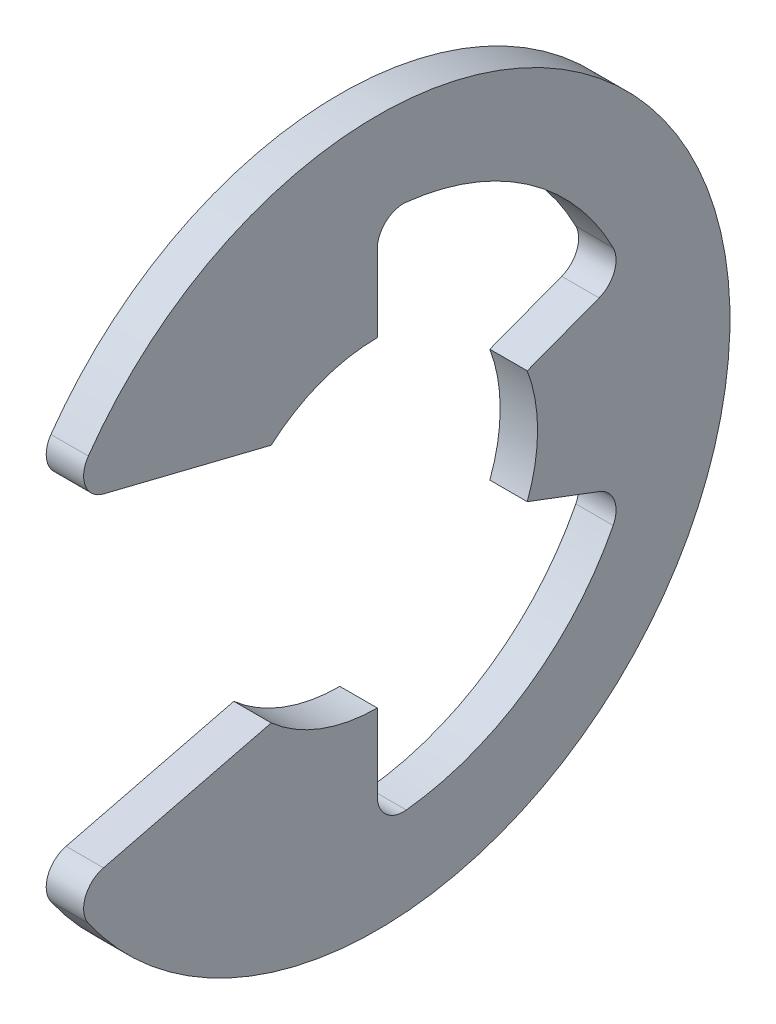
ISO-10303-21;
HEADER;
FILE_DESCRIPTION(('STEP AP214'),'2;1');
FILE_NAME('part.step','',(''),(''),'','','');
FILE_SCHEMA(('AUTOMOTIVE_DESIGN { 1 0 10303 214 1 1 1 1 }'));
ENDSEC;
DATA;
#1=APPLICATION_CONTEXT('core data for automotive mechanical design processes');
#2=APPLICATION_PROTOCOL_DEFINITION('international standard','automotive_design',2000,#1);
#3=PRODUCT_CONTEXT('',#1,'mechanical');
#4=PRODUCT('Part','Part','',(#3));
#5=PRODUCT_RELATED_PRODUCT_CATEGORY('part','',(#4));
#6=PRODUCT_DEFINITION_FORMATION('','',#4);
#7=PRODUCT_DEFINITION_CONTEXT('part definition',#1,'design');
#8=PRODUCT_DEFINITION('design','',#6,#7);
#9=PRODUCT_DEFINITION_SHAPE('','',#8);
#10=(LENGTH_UNIT() NAMED_UNIT(*) SI_UNIT(.MILLI.,.METRE.));
#11=(NAMED_UNIT(*) PLANE_ANGLE_UNIT() SI_UNIT($,.RADIAN.));
#12=(NAMED_UNIT(*) SI_UNIT($,.STERADIAN.) SOLID_ANGLE_UNIT());
#13=UNCERTAINTY_MEASURE_WITH_UNIT(LENGTH_MEASURE(1.E-05),#10,'distance_accuracy_value','');
#14=(GEOMETRIC_REPRESENTATION_CONTEXT(3) GLOBAL_UNCERTAINTY_ASSIGNED_CONTEXT((#13)) GLOBAL_UNIT_ASSIGNED_CONTEXT((#10,
#11,#12)) REPRESENTATION_CONTEXT('',''));
#15=CARTESIAN_POINT('',(0.,0.,0.));
#16=DIRECTION('',(0.,0.,1.));
#17=DIRECTION('',(1.,0.,0.));
#18=AXIS2_PLACEMENT_3D('',#15,#16,#17);
#19=CARTESIAN_POINT('',(0.4445,0.,0.));
#20=DIRECTION('',(1.,0.,0.));
#21=DIRECTION('',(0.,0.,-1.));
#22=AXIS2_PLACEMENT_3D('',#19,#20,#21);
#23=PLANE('',#22);
#24=DIRECTION('',(0.,-1.,0.));
#25=VECTOR('',#24,1.);
#26=CARTESIAN_POINT('',(0.4445,-3.81,0.));
#27=LINE('',#26,#25);
#28=CARTESIAN_POINT('',(0.4445,-5.63609412257,0.));
#29=VERTEX_POINT('',#28);
#30=CARTESIAN_POINT('',(0.4445,-3.81,0.));
#31=VERTEX_POINT('',#30);
#32=EDGE_CURVE('E167',#29,#31,#27,.F.);
#33=ORIENTED_EDGE('',*,*,#32,.T.);
#34=CARTESIAN_POINT('',(0.4445,0.,0.));
#35=DIRECTION('',(-1.,0.,0.));
#36=DIRECTION('',(0.,0.,1.));
#37=AXIS2_PLACEMENT_3D('',#34,#35,#36);
#38=CIRCLE('',#37,3.81);
#39=CARTESIAN_POINT('',(0.4445,-2.85750000000024,2.5200781237894));
#40=VERTEX_POINT('',#39);
#41=EDGE_CURVE('E222',#31,#40,#38,.T.);
#42=ORIENTED_EDGE('',*,*,#41,.T.);
#43=DIRECTION('',(0.,0.24095282060708,-0.970536829925322));
#44=VECTOR('',#43,1.);
#45=CARTESIAN_POINT('',(0.4445,-4.05333224144,7.33678551823));
#46=LINE('',#45,#44);
#47=CARTESIAN_POINT('',(0.4445,-3.84710424199829,6.506117222612));
#48=VERTEX_POINT('',#47);
#49=EDGE_CURVE('E162',#40,#48,#46,.F.);
#50=ORIENTED_EDGE('',*,*,#49,.T.);
#51=CARTESIAN_POINT('',(0.4445,-4.45106931115,6.35617228191));
#52=DIRECTION('',(-1.,0.,0.));
#53=DIRECTION('',(0.,0.,1.));
#54=AXIS2_PLACEMENT_3D('',#51,#52,#53);
#55=CIRCLE('',#54,0.6223);
#56=CARTESIAN_POINT('',(0.4445,-4.80802904314069,6.86591441253935));
#57=VERTEX_POINT('',#56);
#58=EDGE_CURVE('E219',#57,#48,#55,.T.);
#59=ORIENTED_EDGE('',*,*,#58,.F.);
#60=CARTESIAN_POINT('',(0.4445,0.,0.));
#61=DIRECTION('',(-1.,0.,0.));
#62=DIRECTION('',(0.,0.,1.));
#63=AXIS2_PLACEMENT_3D('',#60,#61,#62);
#64=CIRCLE('',#63,8.382);
#65=CARTESIAN_POINT('',(0.4445,4.80802904311024,6.86591441255998));
#66=VERTEX_POINT('',#65);
#67=EDGE_CURVE('E141',#66,#57,#64,.T.);
#68=ORIENTED_EDGE('',*,*,#67,.F.);
#69=CARTESIAN_POINT('',(0.4445,4.45106931115,6.35617228191));
#70=DIRECTION('',(-1.,0.,0.));
#71=DIRECTION('',(0.,0.,1.));
#72=AXIS2_PLACEMENT_3D('',#69,#70,#71);
#73=CIRCLE('',#72,0.6223);
#74=CARTESIAN_POINT('',(0.4445,3.84710424189092,6.50611722217135));
#75=VERTEX_POINT('',#74);
#76=EDGE_CURVE('E20',#75,#66,#73,.T.);
#77=ORIENTED_EDGE('',*,*,#76,.F.);
#78=DIRECTION('',(0.,0.24095282060708,0.970536829925322));
#79=VECTOR('',#78,1.);
#80=CARTESIAN_POINT('',(0.4445,4.05333224144,7.33678551823));
#81=LINE('',#80,#79);
#82=CARTESIAN_POINT('',(0.4445,2.85749999985564,2.52007812395271));
#83=VERTEX_POINT('',#82);
#84=EDGE_CURVE('E138',#75,#83,#81,.F.);
#85=ORIENTED_EDGE('',*,*,#84,.T.);
#86=CARTESIAN_POINT('',(0.4445,0.,0.));
#87=DIRECTION('',(-1.,0.,0.));
#88=DIRECTION('',(0.,0.,1.));
#89=AXIS2_PLACEMENT_3D('',#86,#87,#88);
#90=CIRCLE('',#89,3.81);
#91=CARTESIAN_POINT('',(0.4445,3.81,0.));
#92=VERTEX_POINT('',#91);
#93=EDGE_CURVE('E242',#83,#92,#90,.T.);
#94=ORIENTED_EDGE('',*,*,#93,.T.);
#95=DIRECTION('',(0.,-1.,0.));
#96=VECTOR('',#95,1.);
#97=CARTESIAN_POINT('',(0.4445,3.81,0.));
#98=LINE('',#97,#96);
#99=CARTESIAN_POINT('',(0.4445,5.63609412254,0.));
#100=VERTEX_POINT('',#99);
#101=EDGE_CURVE('E181',#92,#100,#98,.F.);
#102=ORIENTED_EDGE('',*,*,#101,.T.);
#103=CARTESIAN_POINT('',(0.4445,5.63609412254,-0.6223));
#104=DIRECTION('',(-1.,0.,0.));
#105=DIRECTION('',(0.,0.,1.));
#106=AXIS2_PLACEMENT_3D('',#103,#104,#105);
#107=CIRCLE('',#106,0.6223);
#108=CARTESIAN_POINT('',(0.4445,6.25463519415077,-0.69059518820912));
#109=VERTEX_POINT('',#108);
#110=EDGE_CURVE('E241',#100,#109,#107,.T.);
#111=ORIENTED_EDGE('',*,*,#110,.T.);
#112=CARTESIAN_POINT('',(0.4445,0.,0.));
#113=DIRECTION('',(-1.,0.,0.));
#114=DIRECTION('',(0.,0.,1.));
#115=AXIS2_PLACEMENT_3D('',#112,#113,#114);
#116=CIRCLE('',#115,6.29264516129);
#117=CARTESIAN_POINT('',(0.4445,2.85734012662438,-5.60651322362907));
#118=VERTEX_POINT('',#117);
#119=EDGE_CURVE('E237',#109,#118,#116,.T.);
#120=ORIENTED_EDGE('',*,*,#119,.T.);
#121=CARTESIAN_POINT('',(0.4445,2.57476853468,-5.05206702658));
#122=DIRECTION('',(-1.,0.,0.));
#123=DIRECTION('',(0.,0.,1.));
#124=AXIS2_PLACEMENT_3D('',#121,#122,#123);
#125=CIRCLE('',#124,0.6223);
#126=CARTESIAN_POINT('',(0.4445,1.99266018674025,-5.27208330157347));
#127=VERTEX_POINT('',#126);
#128=EDGE_CURVE('E234',#118,#127,#125,.T.);
#129=ORIENTED_EDGE('',*,*,#128,.T.);
#130=DIRECTION('',(0.,0.353553390593195,-0.935414346693515));
#131=VECTOR('',#130,1.);
#132=CARTESIAN_POINT('',(0.4445,1.34703841816,-3.5639286609));
#133=LINE('',#132,#131);
#134=CARTESIAN_POINT('',(0.4445,1.34703841816077,-3.56392866090203));
#135=VERTEX_POINT('',#134);
#136=EDGE_CURVE('E176',#127,#135,#133,.F.);
#137=ORIENTED_EDGE('',*,*,#136,.T.);
#138=CARTESIAN_POINT('',(0.4445,0.,0.));
#139=DIRECTION('',(-1.,0.,0.));
#140=DIRECTION('',(0.,0.,1.));
#141=AXIS2_PLACEMENT_3D('',#138,#139,#140);
#142=CIRCLE('',#141,3.81);
#143=CARTESIAN_POINT('',(0.4445,-1.34703841816038,-3.56392866090102));
#144=VERTEX_POINT('',#143);
#145=EDGE_CURVE('E232',#135,#144,#142,.T.);
#146=ORIENTED_EDGE('',*,*,#145,.T.);
#147=DIRECTION('',(0.,0.353553390593195,0.935414346693515));
#148=VECTOR('',#147,1.);
#149=CARTESIAN_POINT('',(0.4445,-1.34703841816,-3.5639286609));
#150=LINE('',#149,#148);
#151=CARTESIAN_POINT('',(0.4445,-1.99266018674143,-5.27208330157303));
#152=VERTEX_POINT('',#151);
#153=EDGE_CURVE('E171',#144,#152,#150,.F.);
#154=ORIENTED_EDGE('',*,*,#153,.T.);
#155=CARTESIAN_POINT('',(0.4445,-2.57476853468,-5.05206702658));
#156=DIRECTION('',(-1.,0.,0.));
#157=DIRECTION('',(0.,0.,1.));
#158=AXIS2_PLACEMENT_3D('',#155,#156,#157);
#159=CIRCLE('',#158,0.6223);
#160=CARTESIAN_POINT('',(0.4445,-2.85734012662438,-5.60651322362907));
#161=VERTEX_POINT('',#160);
#162=EDGE_CURVE('E230',#152,#161,#159,.T.);
#163=ORIENTED_EDGE('',*,*,#162,.T.);
#164=CARTESIAN_POINT('',(0.4445,0.,0.));
#165=DIRECTION('',(-1.,0.,0.));
#166=DIRECTION('',(0.,0.,1.));
#167=AXIS2_PLACEMENT_3D('',#164,#165,#166);
#168=CIRCLE('',#167,6.29264516129);
#169=CARTESIAN_POINT('',(0.4445,-6.25463519415077,-0.69059518820912));
#170=VERTEX_POINT('',#169);
#171=EDGE_CURVE('E227',#161,#170,#168,.T.);
#172=ORIENTED_EDGE('',*,*,#171,.T.);
#173=CARTESIAN_POINT('',(0.4445,-5.63609412254,-0.6223));
#174=DIRECTION('',(-1.,0.,0.));
#175=DIRECTION('',(0.,0.,1.));
#176=AXIS2_PLACEMENT_3D('',#173,#174,#175);
#177=CIRCLE('',#176,0.6223);
#178=EDGE_CURVE('E224',#170,#29,#177,.T.);
#179=ORIENTED_EDGE('',*,*,#178,.T.);
#180=EDGE_LOOP('',(#33,#42,#50,#59,#68,#77,#85,#94,#102,#111,#120,#129,#137,#146,#154,#163,#172,#179));
#181=FACE_BOUND('',#180,.T.);
#182=ADVANCED_FACE('F17',(#181),#23,.T.);
#183=CARTESIAN_POINT('',(0.4445,4.45106931115,6.35617228191));
#184=DIRECTION('',(-1.,0.,0.));
#185=DIRECTION('',(0.,0.,1.));
#186=AXIS2_PLACEMENT_3D('',#183,#184,#185);
#187=CYLINDRICAL_SURFACE('',#186,0.6223);
#188=CARTESIAN_POINT('',(-0.4445,4.45106931115,6.35617228191));
#189=DIRECTION('',(-1.,0.,0.));
#190=DIRECTION('',(0.,0.,1.));
#191=AXIS2_PLACEMENT_3D('',#188,#189,#190);
#192=CIRCLE('',#191,0.6223);
#193=CARTESIAN_POINT('',(-0.4445,4.80802904311024,6.86591441255998));
#194=VERTEX_POINT('',#193);
#195=CARTESIAN_POINT('',(-0.444500000216,3.84710424189057,6.5061172221717));
#196=VERTEX_POINT('',#195);
#197=EDGE_CURVE('E157',#194,#196,#192,.F.);
#198=ORIENTED_EDGE('',*,*,#197,.T.);
#199=DIRECTION('',(1.,0.,0.));
#200=VECTOR('',#199,1.);
#201=CARTESIAN_POINT('',(0.4445,3.84710424189055,6.50611722216986));
#202=LINE('',#201,#200);
#203=EDGE_CURVE('E146',#196,#75,#202,.T.);
#204=ORIENTED_EDGE('',*,*,#203,.T.);
#205=ORIENTED_EDGE('',*,*,#76,.T.);
#206=DIRECTION('',(-1.,0.,0.));
#207=VECTOR('',#206,1.);
#208=CARTESIAN_POINT('',(0.4445,4.80802904307967,6.86591441258209));
#209=LINE('',#208,#207);
#210=EDGE_CURVE('E218',#194,#66,#209,.F.);
#211=ORIENTED_EDGE('',*,*,#210,.F.);
#212=EDGE_LOOP('',(#198,#204,#205,#211));
#213=FACE_BOUND('',#212,.T.);
#214=ADVANCED_FACE('F155',(#213),#187,.T.);
#215=CARTESIAN_POINT('',(0.4445,4.05333224144,7.33678551823));
#216=DIRECTION('',(0.,0.970536829925322,-0.24095282060708));
#217=DIRECTION('',(0.,0.24095282060708,0.970536829925322));
#218=AXIS2_PLACEMENT_3D('',#215,#216,#217);
#219=PLANE('',#218);
#220=ORIENTED_EDGE('',*,*,#203,.F.);
#221=DIRECTION('',(0.,-0.240952820607887,-0.970536829925121));
#222=VECTOR('',#221,1.);
#223=CARTESIAN_POINT('',(-0.4445,3.84710424189,6.50611722217));
#224=LINE('',#223,#222);
#225=CARTESIAN_POINT('',(-0.444500000216,2.85749999994027,2.52007812393312));
#226=VERTEX_POINT('',#225);
#227=EDGE_CURVE('E215',#196,#226,#224,.T.);
#228=ORIENTED_EDGE('',*,*,#227,.T.);
#229=DIRECTION('',(-1.,0.,0.));
#230=VECTOR('',#229,1.);
#231=CARTESIAN_POINT('',(0.4445,2.85749999971117,2.52007812411653));
#232=LINE('',#231,#230);
#233=EDGE_CURVE('E153',#226,#83,#232,.F.);
#234=ORIENTED_EDGE('',*,*,#233,.T.);
#235=ORIENTED_EDGE('',*,*,#84,.F.);
#236=EDGE_LOOP('',(#220,#228,#234,#235));
#237=FACE_BOUND('',#236,.T.);
#238=ADVANCED_FACE('F150',(#237),#219,.F.);
#239=CARTESIAN_POINT('',(0.4445,0.,0.));
#240=DIRECTION('',(-1.,0.,0.));
#241=DIRECTION('',(0.,0.,1.));
#242=AXIS2_PLACEMENT_3D('',#239,#240,#241);
#243=CYLINDRICAL_SURFACE('',#242,3.81);
#244=DIRECTION('',(1.,0.,0.));
#245=VECTOR('',#244,1.);
#246=CARTESIAN_POINT('',(0.4445,3.81,0.));
#247=LINE('',#246,#245);
#248=CARTESIAN_POINT('',(-0.444500000216,3.81,0.));
#249=VERTEX_POINT('',#248);
#250=EDGE_CURVE('E183',#249,#92,#247,.T.);
#251=ORIENTED_EDGE('',*,*,#250,.T.);
#252=ORIENTED_EDGE('',*,*,#93,.F.);
#253=ORIENTED_EDGE('',*,*,#233,.F.);
#254=CARTESIAN_POINT('',(-0.444500000432,0.,0.));
#255=DIRECTION('',(-1.,0.,0.));
#256=DIRECTION('',(0.,0.,1.));
#257=AXIS2_PLACEMENT_3D('',#254,#255,#256);
#258=CIRCLE('',#257,3.81);
#259=EDGE_CURVE('E212',#226,#249,#258,.T.);
#260=ORIENTED_EDGE('',*,*,#259,.T.);
#261=EDGE_LOOP('',(#251,#252,#253,#260));
#262=FACE_BOUND('',#261,.T.);
#263=ADVANCED_FACE('F471',(#262),#243,.F.);
#264=CARTESIAN_POINT('',(0.4445,3.81,0.));
#265=DIRECTION('',(0.,0.,1.));
#266=DIRECTION('',(0.,-1.,0.));
#267=AXIS2_PLACEMENT_3D('',#264,#265,#266);
#268=PLANE('',#267);
#269=DIRECTION('',(-1.,0.,0.));
#270=VECTOR('',#269,1.);
#271=CARTESIAN_POINT('',(0.4445,5.63609412254,0.));
#272=LINE('',#271,#270);
#273=CARTESIAN_POINT('',(-0.444500000216,5.63609412254,0.));
#274=VERTEX_POINT('',#273);
#275=EDGE_CURVE('E182',#274,#100,#272,.F.);
#276=ORIENTED_EDGE('',*,*,#275,.T.);
#277=ORIENTED_EDGE('',*,*,#101,.F.);
#278=ORIENTED_EDGE('',*,*,#250,.F.);
#279=DIRECTION('',(0.,1.,0.));
#280=VECTOR('',#279,1.);
#281=CARTESIAN_POINT('',(-0.4445,0.,0.));
#282=LINE('',#281,#280);
#283=EDGE_CURVE('E211',#249,#274,#282,.T.);
#284=ORIENTED_EDGE('',*,*,#283,.T.);
#285=EDGE_LOOP('',(#276,#277,#278,#284));
#286=FACE_BOUND('',#285,.T.);
#287=ADVANCED_FACE('F338',(#286),#268,.F.);
#288=CARTESIAN_POINT('',(0.4445,5.63609412254,-0.6223));
#289=DIRECTION('',(-1.,0.,0.));
#290=DIRECTION('',(0.,0.,1.));
#291=AXIS2_PLACEMENT_3D('',#288,#289,#290);
#292=CYLINDRICAL_SURFACE('',#291,0.6223);
#293=ORIENTED_EDGE('',*,*,#275,.F.);
#294=CARTESIAN_POINT('',(-0.444500000432,5.63609412254,-0.6223));
#295=DIRECTION('',(-1.,0.,0.));
#296=DIRECTION('',(0.,0.,1.));
#297=AXIS2_PLACEMENT_3D('',#294,#295,#296);
#298=CIRCLE('',#297,0.6223);
#299=CARTESIAN_POINT('',(-0.444500000432,6.25463519415231,-0.69059518820929));
#300=VERTEX_POINT('',#299);
#301=EDGE_CURVE('E208',#274,#300,#298,.T.);
#302=ORIENTED_EDGE('',*,*,#301,.T.);
#303=DIRECTION('',(-1.,0.,0.));
#304=VECTOR('',#303,1.);
#305=CARTESIAN_POINT('',(0.4445,6.25463519415231,-0.690595188209255));
#306=LINE('',#305,#304);
#307=EDGE_CURVE('E240',#300,#109,#306,.F.);
#308=ORIENTED_EDGE('',*,*,#307,.T.);
#309=ORIENTED_EDGE('',*,*,#110,.F.);
#310=EDGE_LOOP('',(#293,#302,#308,#309));
#311=FACE_BOUND('',#310,.T.);
#312=ADVANCED_FACE('F334',(#311),#292,.F.);
#313=CARTESIAN_POINT('',(0.4445,0.,0.));
#314=DIRECTION('',(-1.,0.,0.));
#315=DIRECTION('',(0.,0.,1.));
#316=AXIS2_PLACEMENT_3D('',#313,#314,#315);
#317=CYLINDRICAL_SURFACE('',#316,6.29264516129);
#318=ORIENTED_EDGE('',*,*,#307,.F.);
#319=CARTESIAN_POINT('',(-0.444500000432,0.,0.));
#320=DIRECTION('',(-1.,0.,0.));
#321=DIRECTION('',(0.,0.,1.));
#322=AXIS2_PLACEMENT_3D('',#319,#320,#321);
#323=CIRCLE('',#322,6.29264516129);
#324=CARTESIAN_POINT('',(-0.444500000192295,2.85734012662578,-5.60651322363182));
#325=VERTEX_POINT('',#324);
#326=EDGE_CURVE('E205',#300,#325,#323,.T.);
#327=ORIENTED_EDGE('',*,*,#326,.T.);
#328=DIRECTION('',(-1.,0.,0.));
#329=VECTOR('',#328,1.);
#330=CARTESIAN_POINT('',(0.4445,2.85734012662193,-5.60651322363378));
#331=LINE('',#330,#329);
#332=EDGE_CURVE('E236',#325,#118,#331,.F.);
#333=ORIENTED_EDGE('',*,*,#332,.T.);
#334=ORIENTED_EDGE('',*,*,#119,.F.);
#335=EDGE_LOOP('',(#318,#327,#333,#334));
#336=FACE_BOUND('',#335,.T.);
#337=ADVANCED_FACE('F330',(#336),#317,.F.);
#338=CARTESIAN_POINT('',(0.4445,2.57476853468,-5.05206702658));
#339=DIRECTION('',(-1.,0.,0.));
#340=DIRECTION('',(0.,0.,1.));
#341=AXIS2_PLACEMENT_3D('',#338,#339,#340);
#342=CYLINDRICAL_SURFACE('',#341,0.6223);
#343=DIRECTION('',(1.,0.,0.));
#344=VECTOR('',#343,1.);
#345=CARTESIAN_POINT('',(0.4445,1.99266018675024,-5.27208330159991));
#346=LINE('',#345,#344);
#347=CARTESIAN_POINT('',(-0.444500000216,1.99266018674005,-5.2720833015735));
#348=VERTEX_POINT('',#347);
#349=EDGE_CURVE('E180',#348,#127,#346,.T.);
#350=ORIENTED_EDGE('',*,*,#349,.T.);
#351=ORIENTED_EDGE('',*,*,#128,.F.);
#352=ORIENTED_EDGE('',*,*,#332,.F.);
#353=CARTESIAN_POINT('',(-0.4445,2.57476853468,-5.05206702658));
#354=DIRECTION('',(-1.,0.,0.));
#355=DIRECTION('',(0.,0.,1.));
#356=AXIS2_PLACEMENT_3D('',#353,#354,#355);
#357=CIRCLE('',#356,0.6223);
#358=EDGE_CURVE('E203',#325,#348,#357,.T.);
#359=ORIENTED_EDGE('',*,*,#358,.T.);
#360=EDGE_LOOP('',(#350,#351,#352,#359));
#361=FACE_BOUND('',#360,.T.);
#362=ADVANCED_FACE('F326',(#361),#342,.F.);
#363=CARTESIAN_POINT('',(0.4445,1.34703841816,-3.5639286609));
#364=DIRECTION('',(0.,-0.935414346693515,-0.353553390593195));
#365=DIRECTION('',(0.,0.353553390593195,-0.935414346693515));
#366=AXIS2_PLACEMENT_3D('',#363,#364,#365);
#367=PLANE('',#366);
#368=ORIENTED_EDGE('',*,*,#349,.F.);
#369=DIRECTION('',(0.,-0.353553390593062,0.935414346693565));
#370=VECTOR('',#369,1.);
#371=CARTESIAN_POINT('',(-0.4445,1.99266018675,-5.2720833016));
#372=LINE('',#371,#370);
#373=CARTESIAN_POINT('',(-0.4445,1.34703841816077,-3.56392866090203));
#374=VERTEX_POINT('',#373);
#375=EDGE_CURVE('E202',#348,#374,#372,.T.);
#376=ORIENTED_EDGE('',*,*,#375,.T.);
#377=DIRECTION('',(-1.,0.,0.));
#378=VECTOR('',#377,1.);
#379=CARTESIAN_POINT('',(0.4445,1.34703841816077,-3.56392866090203));
#380=LINE('',#379,#378);
#381=EDGE_CURVE('E179',#374,#135,#380,.F.);
#382=ORIENTED_EDGE('',*,*,#381,.T.);
#383=ORIENTED_EDGE('',*,*,#136,.F.);
#384=EDGE_LOOP('',(#368,#376,#382,#383));
#385=FACE_BOUND('',#384,.T.);
#386=ADVANCED_FACE('F323',(#385),#367,.F.);
#387=CARTESIAN_POINT('',(0.4445,0.,0.));
#388=DIRECTION('',(-1.,0.,0.));
#389=DIRECTION('',(0.,0.,1.));
#390=AXIS2_PLACEMENT_3D('',#387,#388,#389);
#391=CYLINDRICAL_SURFACE('',#390,3.81);
#392=DIRECTION('',(1.,0.,0.));
#393=VECTOR('',#392,1.);
#394=CARTESIAN_POINT('',(0.4445,-1.34703841816,-3.5639286609));
#395=LINE('',#394,#393);
#396=CARTESIAN_POINT('',(-0.444500000216,-1.34703841816038,-3.56392866090102));
#397=VERTEX_POINT('',#396);
#398=EDGE_CURVE('E175',#397,#144,#395,.T.);
#399=ORIENTED_EDGE('',*,*,#398,.T.);
#400=ORIENTED_EDGE('',*,*,#145,.F.);
#401=ORIENTED_EDGE('',*,*,#381,.F.);
#402=CARTESIAN_POINT('',(-0.4445,0.,0.));
#403=DIRECTION('',(-1.,0.,0.));
#404=DIRECTION('',(0.,0.,1.));
#405=AXIS2_PLACEMENT_3D('',#402,#403,#404);
#406=CIRCLE('',#405,3.81);
#407=EDGE_CURVE('E200',#374,#397,#406,.T.);
#408=ORIENTED_EDGE('',*,*,#407,.T.);
#409=EDGE_LOOP('',(#399,#400,#401,#408));
#410=FACE_BOUND('',#409,.T.);
#411=ADVANCED_FACE('F318',(#410),#391,.F.);
#412=CARTESIAN_POINT('',(0.4445,-1.34703841816,-3.5639286609));
#413=DIRECTION('',(0.,0.935414346693515,-0.353553390593195));
#414=DIRECTION('',(0.,0.353553390593195,0.935414346693515));
#415=AXIS2_PLACEMENT_3D('',#412,#413,#414);
#416=PLANE('',#415);
#417=DIRECTION('',(-1.,0.,0.));
#418=VECTOR('',#417,1.);
#419=CARTESIAN_POINT('',(0.4445,-1.99266018675261,-5.27208330159901));
#420=LINE('',#419,#418);
#421=CARTESIAN_POINT('',(-0.4445,-1.9926601867413,-5.27208330157303));
#422=VERTEX_POINT('',#421);
#423=EDGE_CURVE('E174',#422,#152,#420,.F.);
#424=ORIENTED_EDGE('',*,*,#423,.T.);
#425=ORIENTED_EDGE('',*,*,#153,.F.);
#426=ORIENTED_EDGE('',*,*,#398,.F.);
#427=DIRECTION('',(0.,-0.353553390593062,-0.935414346693565));
#428=VECTOR('',#427,1.);
#429=CARTESIAN_POINT('',(-0.4445,-1.34703841816,-3.5639286609));
#430=LINE('',#429,#428);
#431=EDGE_CURVE('E199',#397,#422,#430,.T.);
#432=ORIENTED_EDGE('',*,*,#431,.T.);
#433=EDGE_LOOP('',(#424,#425,#426,#432));
#434=FACE_BOUND('',#433,.T.);
#435=ADVANCED_FACE('F315',(#434),#416,.F.);
#436=CARTESIAN_POINT('',(0.4445,-2.57476853468,-5.05206702658));
#437=DIRECTION('',(-1.,0.,0.));
#438=DIRECTION('',(0.,0.,1.));
#439=AXIS2_PLACEMENT_3D('',#436,#437,#438);
#440=CYLINDRICAL_SURFACE('',#439,0.6223);
#441=DIRECTION('',(-1.,0.,0.));
#442=VECTOR('',#441,1.);
#443=CARTESIAN_POINT('',(0.4445,-2.85734012661912,-5.60651322362827));
#444=LINE('',#443,#442);
#445=CARTESIAN_POINT('',(-0.444500000432,-2.85734012662297,-5.60651322362631));
#446=VERTEX_POINT('',#445);
#447=EDGE_CURVE('E229',#446,#161,#444,.F.);
#448=ORIENTED_EDGE('',*,*,#447,.T.);
#449=ORIENTED_EDGE('',*,*,#162,.F.);
#450=ORIENTED_EDGE('',*,*,#423,.F.);
#451=CARTESIAN_POINT('',(-0.4445,-2.57476853468,-5.05206702658));
#452=DIRECTION('',(-1.,0.,0.));
#453=DIRECTION('',(0.,0.,1.));
#454=AXIS2_PLACEMENT_3D('',#451,#452,#453);
#455=CIRCLE('',#454,0.6223);
#456=EDGE_CURVE('E197',#422,#446,#455,.T.);
#457=ORIENTED_EDGE('',*,*,#456,.T.);
#458=EDGE_LOOP('',(#448,#449,#450,#457));
#459=FACE_BOUND('',#458,.T.);
#460=ADVANCED_FACE('F339',(#459),#440,.F.);
#461=CARTESIAN_POINT('',(0.4445,0.,0.));
#462=DIRECTION('',(-1.,0.,0.));
#463=DIRECTION('',(0.,0.,1.));
#464=AXIS2_PLACEMENT_3D('',#461,#462,#463);
#465=CYLINDRICAL_SURFACE('',#464,6.29264516129);
#466=DIRECTION('',(-1.,0.,0.));
#467=VECTOR('',#466,1.);
#468=CARTESIAN_POINT('',(0.4445,-6.25463519414924,-0.690595188208916));
#469=LINE('',#468,#467);
#470=CARTESIAN_POINT('',(-0.444500000432,-6.25463519414924,-0.690595188208951));
#471=VERTEX_POINT('',#470);
#472=EDGE_CURVE('E226',#471,#170,#469,.F.);
#473=ORIENTED_EDGE('',*,*,#472,.T.);
#474=ORIENTED_EDGE('',*,*,#171,.F.);
#475=ORIENTED_EDGE('',*,*,#447,.F.);
#476=CARTESIAN_POINT('',(-0.444500000432,0.,0.));
#477=DIRECTION('',(-1.,0.,0.));
#478=DIRECTION('',(0.,0.,1.));
#479=AXIS2_PLACEMENT_3D('',#476,#477,#478);
#480=CIRCLE('',#479,6.29264516129);
#481=EDGE_CURVE('E194',#446,#471,#480,.T.);
#482=ORIENTED_EDGE('',*,*,#481,.T.);
#483=EDGE_LOOP('',(#473,#474,#475,#482));
#484=FACE_BOUND('',#483,.T.);
#485=ADVANCED_FACE('F307',(#484),#465,.F.);
#486=CARTESIAN_POINT('',(0.4445,-5.63609412254,-0.6223));
#487=DIRECTION('',(-1.,0.,0.));
#488=DIRECTION('',(0.,0.,1.));
#489=AXIS2_PLACEMENT_3D('',#486,#487,#488);
#490=CYLINDRICAL_SURFACE('',#489,0.6223);
#491=ORIENTED_EDGE('',*,*,#472,.F.);
#492=CARTESIAN_POINT('',(-0.444500000432,-5.63609412254,-0.6223));
#493=DIRECTION('',(-1.,0.,0.));
#494=DIRECTION('',(0.,0.,1.));
#495=AXIS2_PLACEMENT_3D('',#492,#493,#494);
#496=CIRCLE('',#495,0.6223);
#497=CARTESIAN_POINT('',(-0.444500000216,-5.63609412257,0.));
#498=VERTEX_POINT('',#497);
#499=EDGE_CURVE('E191',#471,#498,#496,.T.);
#500=ORIENTED_EDGE('',*,*,#499,.T.);
#501=DIRECTION('',(1.,0.,0.));
#502=VECTOR('',#501,1.);
#503=CARTESIAN_POINT('',(0.4445,-5.6360941226,0.));
#504=LINE('',#503,#502);
#505=EDGE_CURVE('E170',#498,#29,#504,.T.);
#506=ORIENTED_EDGE('',*,*,#505,.T.);
#507=ORIENTED_EDGE('',*,*,#178,.F.);
#508=EDGE_LOOP('',(#491,#500,#506,#507));
#509=FACE_BOUND('',#508,.T.);
#510=ADVANCED_FACE('F303',(#509),#490,.F.);
#511=CARTESIAN_POINT('',(0.4445,-3.81,0.));
#512=DIRECTION('',(0.,0.,1.));
#513=DIRECTION('',(0.,-1.,0.));
#514=AXIS2_PLACEMENT_3D('',#511,#512,#513);
#515=PLANE('',#514);
#516=ORIENTED_EDGE('',*,*,#505,.F.);
#517=DIRECTION('',(0.,1.,0.));
#518=VECTOR('',#517,1.);
#519=CARTESIAN_POINT('',(-0.4445,0.,0.));
#520=LINE('',#519,#518);
#521=CARTESIAN_POINT('',(-0.444500000216,-3.81,0.));
#522=VERTEX_POINT('',#521);
#523=EDGE_CURVE('E190',#498,#522,#520,.T.);
#524=ORIENTED_EDGE('',*,*,#523,.T.);
#525=DIRECTION('',(-1.,0.,0.));
#526=VECTOR('',#525,1.);
#527=CARTESIAN_POINT('',(0.4445,-3.81,0.));
#528=LINE('',#527,#526);
#529=EDGE_CURVE('E169',#522,#31,#528,.F.);
#530=ORIENTED_EDGE('',*,*,#529,.T.);
#531=ORIENTED_EDGE('',*,*,#32,.F.);
#532=EDGE_LOOP('',(#516,#524,#530,#531));
#533=FACE_BOUND('',#532,.T.);
#534=ADVANCED_FACE('F299',(#533),#515,.F.);
#535=CARTESIAN_POINT('',(0.4445,0.,0.));
#536=DIRECTION('',(-1.,0.,0.));
#537=DIRECTION('',(0.,0.,1.));
#538=AXIS2_PLACEMENT_3D('',#535,#536,#537);
#539=CYLINDRICAL_SURFACE('',#538,3.81);
#540=DIRECTION('',(1.,0.,0.));
#541=VECTOR('',#540,1.);
#542=CARTESIAN_POINT('',(0.4445,-2.85750000000036,2.52007812378991));
#543=LINE('',#542,#541);
#544=CARTESIAN_POINT('',(-0.444500000216,-2.8575,2.5200781237896));
#545=VERTEX_POINT('',#544);
#546=EDGE_CURVE('E166',#545,#40,#543,.T.);
#547=ORIENTED_EDGE('',*,*,#546,.T.);
#548=ORIENTED_EDGE('',*,*,#41,.F.);
#549=ORIENTED_EDGE('',*,*,#529,.F.);
#550=CARTESIAN_POINT('',(-0.444500000432,0.,0.));
#551=DIRECTION('',(-1.,0.,0.));
#552=DIRECTION('',(0.,0.,1.));
#553=AXIS2_PLACEMENT_3D('',#550,#551,#552);
#554=CIRCLE('',#553,3.81);
#555=EDGE_CURVE('E187',#522,#545,#554,.T.);
#556=ORIENTED_EDGE('',*,*,#555,.T.);
#557=EDGE_LOOP('',(#547,#548,#549,#556));
#558=FACE_BOUND('',#557,.T.);
#559=ADVANCED_FACE('F295',(#558),#539,.F.);
#560=CARTESIAN_POINT('',(0.4445,-4.05333224144,7.33678551823));
#561=DIRECTION('',(0.,-0.970536829925322,-0.24095282060708));
#562=DIRECTION('',(0.,0.24095282060708,-0.970536829925322));
#563=AXIS2_PLACEMENT_3D('',#560,#561,#562);
#564=PLANE('',#563);
#565=DIRECTION('',(-1.,0.,0.));
#566=VECTOR('',#565,1.);
#567=CARTESIAN_POINT('',(0.4445,-3.8471042421053,6.50611722305117));
#568=LINE('',#567,#566);
#569=CARTESIAN_POINT('',(-0.444500000216,-3.84710424199994,6.5061172226117));
#570=VERTEX_POINT('',#569);
#571=EDGE_CURVE('E165',#48,#570,#568,.T.);
#572=ORIENTED_EDGE('',*,*,#571,.F.);
#573=ORIENTED_EDGE('',*,*,#49,.F.);
#574=ORIENTED_EDGE('',*,*,#546,.F.);
#575=DIRECTION('',(0.,-0.240952820607384,0.970536829925246));
#576=VECTOR('',#575,1.);
#577=CARTESIAN_POINT('',(-0.4445,-2.8575,2.52007812379));
#578=LINE('',#577,#576);
#579=EDGE_CURVE('E186',#545,#570,#578,.T.);
#580=ORIENTED_EDGE('',*,*,#579,.T.);
#581=EDGE_LOOP('',(#572,#573,#574,#580));
#582=FACE_BOUND('',#581,.T.);
#583=ADVANCED_FACE('F287',(#582),#564,.F.);
#584=CARTESIAN_POINT('',(0.4445,-4.45106931115,6.35617228191));
#585=DIRECTION('',(-1.,0.,0.));
#586=DIRECTION('',(0.,0.,1.));
#587=AXIS2_PLACEMENT_3D('',#584,#585,#586);
#588=CYLINDRICAL_SURFACE('',#587,0.6223);
#589=CARTESIAN_POINT('',(-0.444500000432,-4.45106931115,6.35617228191));
#590=DIRECTION('',(-1.,0.,0.));
#591=DIRECTION('',(0.,0.,1.));
#592=AXIS2_PLACEMENT_3D('',#589,#590,#591);
#593=CIRCLE('',#592,0.6223);
#594=CARTESIAN_POINT('',(-0.444500000432,-4.80802904314069,6.86591441253935));
#595=VERTEX_POINT('',#594);
#596=EDGE_CURVE('E26',#570,#595,#593,.F.);
#597=ORIENTED_EDGE('',*,*,#596,.T.);
#598=DIRECTION('',(-1.,0.,0.));
#599=VECTOR('',#598,1.);
#600=CARTESIAN_POINT('',(0.4445,-4.80802904313993,6.86591441253989));
#601=LINE('',#600,#599);
#602=EDGE_CURVE('E221',#57,#595,#601,.T.);
#603=ORIENTED_EDGE('',*,*,#602,.F.);
#604=ORIENTED_EDGE('',*,*,#58,.T.);
#605=ORIENTED_EDGE('',*,*,#571,.T.);
#606=EDGE_LOOP('',(#597,#603,#604,#605));
#607=FACE_BOUND('',#606,.T.);
#608=ADVANCED_FACE('F355',(#607),#588,.T.);
#609=CARTESIAN_POINT('',(0.4445,0.,0.));
#610=DIRECTION('',(-1.,0.,0.));
#611=DIRECTION('',(0.,0.,1.));
#612=AXIS2_PLACEMENT_3D('',#609,#610,#611);
#613=CYLINDRICAL_SURFACE('',#612,8.382);
#614=ORIENTED_EDGE('',*,*,#210,.T.);
#615=ORIENTED_EDGE('',*,*,#67,.T.);
#616=ORIENTED_EDGE('',*,*,#602,.T.);
#617=CARTESIAN_POINT('',(-0.444500000432,0.,0.));
#618=DIRECTION('',(-1.,0.,0.));
#619=DIRECTION('',(0.,0.,1.));
#620=AXIS2_PLACEMENT_3D('',#617,#618,#619);
#621=CIRCLE('',#620,8.382);
#622=EDGE_CURVE('E11',#595,#194,#621,.F.);
#623=ORIENTED_EDGE('',*,*,#622,.T.);
#624=EDGE_LOOP('',(#614,#615,#616,#623));
#625=FACE_BOUND('',#624,.T.);
#626=ADVANCED_FACE('F350',(#625),#613,.T.);
#627=CARTESIAN_POINT('',(-0.4445,0.,0.));
#628=DIRECTION('',(1.,0.,0.));
#629=DIRECTION('',(0.,0.,-1.));
#630=AXIS2_PLACEMENT_3D('',#627,#628,#629);
#631=PLANE('',#630);
#632=ORIENTED_EDGE('',*,*,#622,.F.);
#633=ORIENTED_EDGE('',*,*,#596,.F.);
#634=ORIENTED_EDGE('',*,*,#579,.F.);
#635=ORIENTED_EDGE('',*,*,#555,.F.);
#636=ORIENTED_EDGE('',*,*,#523,.F.);
#637=ORIENTED_EDGE('',*,*,#499,.F.);
#638=ORIENTED_EDGE('',*,*,#481,.F.);
#639=ORIENTED_EDGE('',*,*,#456,.F.);
#640=ORIENTED_EDGE('',*,*,#431,.F.);
#641=ORIENTED_EDGE('',*,*,#407,.F.);
#642=ORIENTED_EDGE('',*,*,#375,.F.);
#643=ORIENTED_EDGE('',*,*,#358,.F.);
#644=ORIENTED_EDGE('',*,*,#326,.F.);
#645=ORIENTED_EDGE('',*,*,#301,.F.);
#646=ORIENTED_EDGE('',*,*,#283,.F.);
#647=ORIENTED_EDGE('',*,*,#259,.F.);
#648=ORIENTED_EDGE('',*,*,#227,.F.);
#649=ORIENTED_EDGE('',*,*,#197,.F.);
#650=EDGE_LOOP('',(#632,#633,#634,#635,#636,#637,#638,#639,#640,#641,#642,#643,#644,#645,#646,
#647,#648,#649));
#651=FACE_BOUND('',#650,.T.);
#652=ADVANCED_FACE('F292',(#651),#631,.F.);
#653=CLOSED_SHELL('',(#182,#214,#238,#263,#287,#312,#337,#362,#386,#411,#435,#460,#485,#510,
#534,#559,#583,#608,#626,#652));
#654=MANIFOLD_SOLID_BREP('B1',#653);
#655=ADVANCED_BREP_SHAPE_REPRESENTATION('',(#18,#654),#14);
#656=SHAPE_DEFINITION_REPRESENTATION(#9,#655);
ENDSEC;
END-ISO-10303-21;
